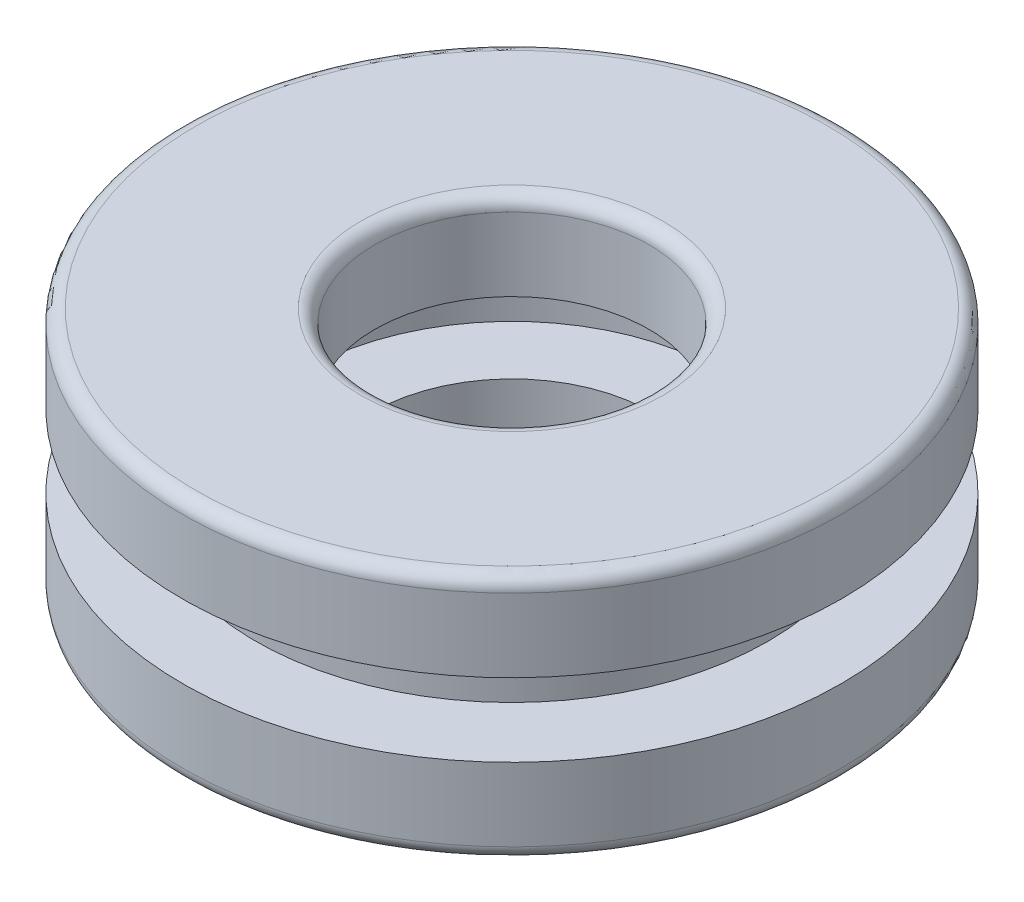
ISO-10303-21;
HEADER;
FILE_DESCRIPTION(('STEP AP214'),'2;1');
FILE_NAME('part.step','',(''),(''),'','','');
FILE_SCHEMA(('AUTOMOTIVE_DESIGN { 1 0 10303 214 1 1 1 1 }'));
ENDSEC;
DATA;
#1=APPLICATION_CONTEXT('core data for automotive mechanical design processes');
#2=APPLICATION_PROTOCOL_DEFINITION('international standard','automotive_design',2000,#1);
#3=PRODUCT_CONTEXT('',#1,'mechanical');
#4=PRODUCT('Part','Part','',(#3));
#5=PRODUCT_RELATED_PRODUCT_CATEGORY('part','',(#4));
#6=PRODUCT_DEFINITION_FORMATION('','',#4);
#7=PRODUCT_DEFINITION_CONTEXT('part definition',#1,'design');
#8=PRODUCT_DEFINITION('design','',#6,#7);
#9=PRODUCT_DEFINITION_SHAPE('','',#8);
#10=(LENGTH_UNIT() NAMED_UNIT(*) SI_UNIT(.MILLI.,.METRE.));
#11=(NAMED_UNIT(*) PLANE_ANGLE_UNIT() SI_UNIT($,.RADIAN.));
#12=(NAMED_UNIT(*) SI_UNIT($,.STERADIAN.) SOLID_ANGLE_UNIT());
#13=UNCERTAINTY_MEASURE_WITH_UNIT(LENGTH_MEASURE(1.E-05),#10,'distance_accuracy_value','');
#14=(GEOMETRIC_REPRESENTATION_CONTEXT(3) GLOBAL_UNCERTAINTY_ASSIGNED_CONTEXT((#13)) GLOBAL_UNIT_ASSIGNED_CONTEXT((#10,
#11,#12)) REPRESENTATION_CONTEXT('',''));
#15=CARTESIAN_POINT('',(0.,0.,0.));
#16=DIRECTION('',(0.,0.,1.));
#17=DIRECTION('',(1.,0.,0.));
#18=AXIS2_PLACEMENT_3D('',#15,#16,#17);
#19=CARTESIAN_POINT('',(3.49720252756924E-12,-1000.,-1.11022302462516E-13));
#20=DIRECTION('',(0.,-1.,0.));
#21=DIRECTION('',(1.,0.,0.));
#22=AXIS2_PLACEMENT_3D('',#19,#20,#21);
#23=CYLINDRICAL_SURFACE('',#22,5.10000000000001);
#24=CARTESIAN_POINT('',(-1.66533453693773E-13,0.499999999999945,0.));
#25=DIRECTION('',(0.,-1.,0.));
#26=DIRECTION('',(1.,0.,0.));
#27=AXIS2_PLACEMENT_3D('',#24,#25,#26);
#28=CIRCLE('',#27,5.1);
#29=CARTESIAN_POINT('',(5.09999999999984,0.499999999999963,0.));
#30=VERTEX_POINT('',#29);
#31=EDGE_CURVE('E10',#30,#30,#28,.T.);
#32=ORIENTED_EDGE('',*,*,#31,.T.);
#33=EDGE_LOOP('',(#32));
#34=FACE_BOUND('',#33,.T.);
#35=CARTESIAN_POINT('',(-1.66533453693773E-13,3.16666666666676,0.));
#36=DIRECTION('',(0.,-1.,0.));
#37=DIRECTION('',(1.,0.,0.));
#38=AXIS2_PLACEMENT_3D('',#35,#36,#37);
#39=CIRCLE('',#38,5.10000000000001);
#40=CARTESIAN_POINT('',(5.09999999999985,3.16666666666678,0.));
#41=VERTEX_POINT('',#40);
#42=EDGE_CURVE('E82',#41,#41,#39,.T.);
#43=ORIENTED_EDGE('',*,*,#42,.F.);
#44=EDGE_LOOP('',(#43));
#45=FACE_BOUND('',#44,.T.);
#46=ADVANCED_FACE('F30',(#34,#45),#23,.F.);
#47=CARTESIAN_POINT('',(-1.66533453693773E-13,0.5,0.));
#48=DIRECTION('',(0.,-1.,0.));
#49=DIRECTION('',(1.,0.,0.));
#50=AXIS2_PLACEMENT_3D('',#47,#48,#49);
#51=TOROIDAL_SURFACE('',#50,5.6,0.5);
#52=CARTESIAN_POINT('',(0.,0.,0.));
#53=DIRECTION('',(0.,-1.,0.));
#54=DIRECTION('',(1.,0.,0.));
#55=AXIS2_PLACEMENT_3D('',#52,#53,#54);
#56=CIRCLE('',#55,5.6);
#57=CARTESIAN_POINT('',(5.60000000000001,0.,0.));
#58=VERTEX_POINT('',#57);
#59=EDGE_CURVE('E36',#58,#58,#56,.T.);
#60=ORIENTED_EDGE('',*,*,#59,.T.);
#61=EDGE_LOOP('',(#60));
#62=FACE_BOUND('',#61,.T.);
#63=ORIENTED_EDGE('',*,*,#31,.F.);
#64=EDGE_LOOP('',(#63));
#65=FACE_BOUND('',#64,.T.);
#66=ADVANCED_FACE('F90',(#62,#65),#51,.T.);
#67=CARTESIAN_POINT('',(5.59999999999999,0.,1.11022302462516E-13));
#68=DIRECTION('',(0.,-1.,0.));
#69=DIRECTION('',(1.,0.,0.));
#70=AXIS2_PLACEMENT_3D('',#67,#68,#69);
#71=PLANE('',#70);
#72=CARTESIAN_POINT('',(0.,0.,0.));
#73=DIRECTION('',(0.,-1.,0.));
#74=DIRECTION('',(1.,0.,0.));
#75=AXIS2_PLACEMENT_3D('',#72,#73,#74);
#76=CIRCLE('',#75,11.5);
#77=CARTESIAN_POINT('',(11.5,0.,0.));
#78=VERTEX_POINT('',#77);
#79=EDGE_CURVE('E40',#78,#78,#76,.T.);
#80=ORIENTED_EDGE('',*,*,#79,.T.);
#81=EDGE_LOOP('',(#80));
#82=FACE_BOUND('',#81,.T.);
#83=ORIENTED_EDGE('',*,*,#59,.F.);
#84=EDGE_LOOP('',(#83));
#85=FACE_BOUND('',#84,.T.);
#86=ADVANCED_FACE('F94',(#82,#85),#71,.T.);
#87=CARTESIAN_POINT('',(-1.66533453693773E-13,0.5,0.));
#88=DIRECTION('',(0.,-1.,0.));
#89=DIRECTION('',(1.,0.,0.));
#90=AXIS2_PLACEMENT_3D('',#87,#88,#89);
#91=TOROIDAL_SURFACE('',#90,11.5,0.5);
#92=CARTESIAN_POINT('',(-1.66533453693773E-13,0.499999999999945,0.));
#93=DIRECTION('',(0.,-1.,0.));
#94=DIRECTION('',(1.,0.,0.));
#95=AXIS2_PLACEMENT_3D('',#92,#93,#94);
#96=CIRCLE('',#95,12.);
#97=CARTESIAN_POINT('',(11.9999999999998,0.499999999999987,0.));
#98=VERTEX_POINT('',#97);
#99=EDGE_CURVE('E44',#98,#98,#96,.T.);
#100=ORIENTED_EDGE('',*,*,#99,.T.);
#101=EDGE_LOOP('',(#100));
#102=FACE_BOUND('',#101,.T.);
#103=ORIENTED_EDGE('',*,*,#79,.F.);
#104=EDGE_LOOP('',(#103));
#105=FACE_BOUND('',#104,.T.);
#106=ADVANCED_FACE('F98',(#102,#105),#91,.T.);
#107=CARTESIAN_POINT('',(3.49720252756924E-12,-1000.,-1.11022302462516E-13));
#108=DIRECTION('',(0.,-1.,0.));
#109=DIRECTION('',(1.,0.,0.));
#110=AXIS2_PLACEMENT_3D('',#107,#108,#109);
#111=CYLINDRICAL_SURFACE('',#110,12.);
#112=CARTESIAN_POINT('',(-1.66533453693773E-13,3.16666666666676,0.));
#113=DIRECTION('',(0.,-1.,0.));
#114=DIRECTION('',(1.,0.,0.));
#115=AXIS2_PLACEMENT_3D('',#112,#113,#114);
#116=CIRCLE('',#115,12.);
#117=CARTESIAN_POINT('',(11.9999999999999,3.1666666666668,0.));
#118=VERTEX_POINT('',#117);
#119=EDGE_CURVE('E49',#118,#118,#116,.T.);
#120=ORIENTED_EDGE('',*,*,#119,.T.);
#121=EDGE_LOOP('',(#120));
#122=FACE_BOUND('',#121,.T.);
#123=ORIENTED_EDGE('',*,*,#99,.F.);
#124=EDGE_LOOP('',(#123));
#125=FACE_BOUND('',#124,.T.);
#126=ADVANCED_FACE('F105',(#122,#125),#111,.T.);
#127=CARTESIAN_POINT('',(9.33333333333336,3.16666666666666,0.));
#128=DIRECTION('',(0.,1.,0.));
#129=DIRECTION('',(-1.,0.,0.));
#130=AXIS2_PLACEMENT_3D('',#127,#128,#129);
#131=PLANE('',#130);
#132=CARTESIAN_POINT('',(-1.66533453693773E-13,3.16666666666676,0.));
#133=DIRECTION('',(0.,-1.,0.));
#134=DIRECTION('',(1.,0.,0.));
#135=AXIS2_PLACEMENT_3D('',#132,#133,#134);
#136=CIRCLE('',#135,9.33333333333336);
#137=CARTESIAN_POINT('',(9.3333333333332,3.16666666666679,0.));
#138=VERTEX_POINT('',#137);
#139=EDGE_CURVE('E52',#138,#138,#136,.T.);
#140=ORIENTED_EDGE('',*,*,#139,.T.);
#141=EDGE_LOOP('',(#140));
#142=FACE_BOUND('',#141,.T.);
#143=ORIENTED_EDGE('',*,*,#119,.F.);
#144=EDGE_LOOP('',(#143));
#145=FACE_BOUND('',#144,.T.);
#146=ADVANCED_FACE('F109',(#142,#145),#131,.T.);
#147=CARTESIAN_POINT('',(3.49720252756924E-12,-1000.,-1.11022302462516E-13));
#148=DIRECTION('',(0.,-1.,0.));
#149=DIRECTION('',(1.,0.,0.));
#150=AXIS2_PLACEMENT_3D('',#147,#148,#149);
#151=CYLINDRICAL_SURFACE('',#150,9.33333333333336);
#152=CARTESIAN_POINT('',(1.11022302462516E-13,5.83333333333336,0.));
#153=DIRECTION('',(0.,-1.,0.));
#154=DIRECTION('',(1.,0.,0.));
#155=AXIS2_PLACEMENT_3D('',#152,#153,#154);
#156=CIRCLE('',#155,9.33333333333337);
#157=CARTESIAN_POINT('',(9.33333333333348,5.83333333333339,0.));
#158=VERTEX_POINT('',#157);
#159=EDGE_CURVE('E55',#158,#158,#156,.T.);
#160=ORIENTED_EDGE('',*,*,#159,.T.);
#161=EDGE_LOOP('',(#160));
#162=FACE_BOUND('',#161,.T.);
#163=ORIENTED_EDGE('',*,*,#139,.F.);
#164=EDGE_LOOP('',(#163));
#165=FACE_BOUND('',#164,.T.);
#166=ADVANCED_FACE('F113',(#162,#165),#151,.T.);
#167=CARTESIAN_POINT('',(9.33333333333347,5.83333333333333,-1.66533453693773E-13));
#168=DIRECTION('',(0.,-1.,0.));
#169=DIRECTION('',(1.,0.,0.));
#170=AXIS2_PLACEMENT_3D('',#167,#168,#169);
#171=PLANE('',#170);
#172=CARTESIAN_POINT('',(1.11022302462516E-13,5.83333333333336,0.));
#173=DIRECTION('',(0.,-1.,0.));
#174=DIRECTION('',(1.,0.,0.));
#175=AXIS2_PLACEMENT_3D('',#172,#173,#174);
#176=CIRCLE('',#175,12.);
#177=CARTESIAN_POINT('',(12.0000000000002,5.8333333333334,0.));
#178=VERTEX_POINT('',#177);
#179=EDGE_CURVE('E58',#178,#178,#176,.T.);
#180=ORIENTED_EDGE('',*,*,#179,.T.);
#181=EDGE_LOOP('',(#180));
#182=FACE_BOUND('',#181,.T.);
#183=ORIENTED_EDGE('',*,*,#159,.F.);
#184=EDGE_LOOP('',(#183));
#185=FACE_BOUND('',#184,.T.);
#186=ADVANCED_FACE('F117',(#182,#185),#171,.T.);
#187=CARTESIAN_POINT('',(3.49720252756924E-12,-1000.,-1.11022302462516E-13));
#188=DIRECTION('',(0.,-1.,0.));
#189=DIRECTION('',(1.,0.,0.));
#190=AXIS2_PLACEMENT_3D('',#187,#188,#189);
#191=CYLINDRICAL_SURFACE('',#190,12.);
#192=CARTESIAN_POINT('',(-1.66533453693773E-13,8.49999999999995,0.));
#193=DIRECTION('',(0.,-1.,0.));
#194=DIRECTION('',(1.,0.,0.));
#195=AXIS2_PLACEMENT_3D('',#192,#193,#194);
#196=CIRCLE('',#195,12.);
#197=CARTESIAN_POINT('',(11.9999999999999,8.49999999999999,0.));
#198=VERTEX_POINT('',#197);
#199=EDGE_CURVE('E61',#198,#198,#196,.T.);
#200=ORIENTED_EDGE('',*,*,#199,.T.);
#201=EDGE_LOOP('',(#200));
#202=FACE_BOUND('',#201,.T.);
#203=ORIENTED_EDGE('',*,*,#179,.F.);
#204=EDGE_LOOP('',(#203));
#205=FACE_BOUND('',#204,.T.);
#206=ADVANCED_FACE('F121',(#202,#205),#191,.T.);
#207=CARTESIAN_POINT('',(-1.66533453693773E-13,8.5,0.));
#208=DIRECTION('',(0.,-1.,0.));
#209=DIRECTION('',(1.,0.,0.));
#210=AXIS2_PLACEMENT_3D('',#207,#208,#209);
#211=TOROIDAL_SURFACE('',#210,11.5,0.499999999999994);
#212=CARTESIAN_POINT('',(-1.66533453693773E-13,8.9999999999999,0.));
#213=DIRECTION('',(0.,-1.,0.));
#214=DIRECTION('',(1.,0.,0.));
#215=AXIS2_PLACEMENT_3D('',#212,#213,#214);
#216=CIRCLE('',#215,11.5);
#217=CARTESIAN_POINT('',(11.4999999999999,8.99999999999994,0.));
#218=VERTEX_POINT('',#217);
#219=EDGE_CURVE('E64',#218,#218,#216,.T.);
#220=ORIENTED_EDGE('',*,*,#219,.T.);
#221=EDGE_LOOP('',(#220));
#222=FACE_BOUND('',#221,.T.);
#223=ORIENTED_EDGE('',*,*,#199,.F.);
#224=EDGE_LOOP('',(#223));
#225=FACE_BOUND('',#224,.T.);
#226=ADVANCED_FACE('F125',(#222,#225),#211,.T.);
#227=CARTESIAN_POINT('',(5.49999999999984,8.99999999999999,1.11022302462516E-13));
#228=DIRECTION('',(0.,1.,0.));
#229=DIRECTION('',(-1.,0.,0.));
#230=AXIS2_PLACEMENT_3D('',#227,#228,#229);
#231=PLANE('',#230);
#232=CARTESIAN_POINT('',(-1.66533453693773E-13,8.9999999999999,0.));
#233=DIRECTION('',(0.,-1.,0.));
#234=DIRECTION('',(1.,0.,0.));
#235=AXIS2_PLACEMENT_3D('',#232,#233,#234);
#236=CIRCLE('',#235,5.50000000000004);
#237=CARTESIAN_POINT('',(5.49999999999988,8.99999999999992,0.));
#238=VERTEX_POINT('',#237);
#239=EDGE_CURVE('E67',#238,#238,#236,.T.);
#240=ORIENTED_EDGE('',*,*,#239,.T.);
#241=EDGE_LOOP('',(#240));
#242=FACE_BOUND('',#241,.T.);
#243=ORIENTED_EDGE('',*,*,#219,.F.);
#244=EDGE_LOOP('',(#243));
#245=FACE_BOUND('',#244,.T.);
#246=ADVANCED_FACE('F129',(#242,#245),#231,.T.);
#247=CARTESIAN_POINT('',(-1.66533453693773E-13,8.5,0.));
#248=DIRECTION('',(0.,-1.,0.));
#249=DIRECTION('',(1.,0.,0.));
#250=AXIS2_PLACEMENT_3D('',#247,#248,#249);
#251=TOROIDAL_SURFACE('',#250,5.50000000000004,0.5);
#252=CARTESIAN_POINT('',(-1.66533453693773E-13,8.49999999999995,0.));
#253=DIRECTION('',(0.,-1.,0.));
#254=DIRECTION('',(1.,0.,0.));
#255=AXIS2_PLACEMENT_3D('',#252,#253,#254);
#256=CIRCLE('',#255,5.00000000000003);
#257=CARTESIAN_POINT('',(4.99999999999987,8.49999999999997,0.));
#258=VERTEX_POINT('',#257);
#259=EDGE_CURVE('E70',#258,#258,#256,.T.);
#260=ORIENTED_EDGE('',*,*,#259,.T.);
#261=EDGE_LOOP('',(#260));
#262=FACE_BOUND('',#261,.T.);
#263=ORIENTED_EDGE('',*,*,#239,.F.);
#264=EDGE_LOOP('',(#263));
#265=FACE_BOUND('',#264,.T.);
#266=ADVANCED_FACE('F133',(#262,#265),#251,.T.);
#267=CARTESIAN_POINT('',(3.49720252756924E-12,-1000.,-1.11022302462516E-13));
#268=DIRECTION('',(0.,-1.,0.));
#269=DIRECTION('',(1.,0.,0.));
#270=AXIS2_PLACEMENT_3D('',#267,#268,#269);
#271=CYLINDRICAL_SURFACE('',#270,5.00000000000003);
#272=CARTESIAN_POINT('',(1.11022302462516E-13,5.83333333333336,0.));
#273=DIRECTION('',(0.,-1.,0.));
#274=DIRECTION('',(1.,0.,0.));
#275=AXIS2_PLACEMENT_3D('',#272,#273,#274);
#276=CIRCLE('',#275,5.00000000000002);
#277=CARTESIAN_POINT('',(5.00000000000014,5.83333333333337,0.));
#278=VERTEX_POINT('',#277);
#279=EDGE_CURVE('E73',#278,#278,#276,.T.);
#280=ORIENTED_EDGE('',*,*,#279,.T.);
#281=EDGE_LOOP('',(#280));
#282=FACE_BOUND('',#281,.T.);
#283=ORIENTED_EDGE('',*,*,#259,.F.);
#284=EDGE_LOOP('',(#283));
#285=FACE_BOUND('',#284,.T.);
#286=ADVANCED_FACE('F137',(#282,#285),#271,.F.);
#287=CARTESIAN_POINT('',(5.00000000000012,5.83333333333334,0.));
#288=DIRECTION('',(0.,-1.,0.));
#289=DIRECTION('',(1.,0.,0.));
#290=AXIS2_PLACEMENT_3D('',#287,#288,#289);
#291=PLANE('',#290);
#292=CARTESIAN_POINT('',(1.11022302462516E-13,5.83333333333336,0.));
#293=DIRECTION('',(0.,-1.,0.));
#294=DIRECTION('',(1.,0.,0.));
#295=AXIS2_PLACEMENT_3D('',#292,#293,#294);
#296=CIRCLE('',#295,7.66666666666669);
#297=CARTESIAN_POINT('',(7.66666666666681,5.83333333333338,0.));
#298=VERTEX_POINT('',#297);
#299=EDGE_CURVE('E76',#298,#298,#296,.T.);
#300=ORIENTED_EDGE('',*,*,#299,.T.);
#301=EDGE_LOOP('',(#300));
#302=FACE_BOUND('',#301,.T.);
#303=ORIENTED_EDGE('',*,*,#279,.F.);
#304=EDGE_LOOP('',(#303));
#305=FACE_BOUND('',#304,.T.);
#306=ADVANCED_FACE('F141',(#302,#305),#291,.T.);
#307=CARTESIAN_POINT('',(3.49720252756924E-12,-1000.,-1.11022302462516E-13));
#308=DIRECTION('',(0.,-1.,0.));
#309=DIRECTION('',(1.,0.,0.));
#310=AXIS2_PLACEMENT_3D('',#307,#308,#309);
#311=CYLINDRICAL_SURFACE('',#310,7.66666666666668);
#312=CARTESIAN_POINT('',(-1.66533453693773E-13,3.16666666666676,0.));
#313=DIRECTION('',(0.,-1.,0.));
#314=DIRECTION('',(1.,0.,0.));
#315=AXIS2_PLACEMENT_3D('',#312,#313,#314);
#316=CIRCLE('',#315,7.66666666666668);
#317=CARTESIAN_POINT('',(7.66666666666652,3.16666666666679,0.));
#318=VERTEX_POINT('',#317);
#319=EDGE_CURVE('E79',#318,#318,#316,.T.);
#320=ORIENTED_EDGE('',*,*,#319,.T.);
#321=EDGE_LOOP('',(#320));
#322=FACE_BOUND('',#321,.T.);
#323=ORIENTED_EDGE('',*,*,#299,.F.);
#324=EDGE_LOOP('',(#323));
#325=FACE_BOUND('',#324,.T.);
#326=ADVANCED_FACE('F145',(#322,#325),#311,.F.);
#327=CARTESIAN_POINT('',(5.09999999999994,3.16666666666669,0.));
#328=DIRECTION('',(0.,1.,0.));
#329=DIRECTION('',(-1.,0.,0.));
#330=AXIS2_PLACEMENT_3D('',#327,#328,#329);
#331=PLANE('',#330);
#332=ORIENTED_EDGE('',*,*,#42,.T.);
#333=EDGE_LOOP('',(#332));
#334=FACE_BOUND('',#333,.T.);
#335=ORIENTED_EDGE('',*,*,#319,.F.);
#336=EDGE_LOOP('',(#335));
#337=FACE_BOUND('',#336,.T.);
#338=ADVANCED_FACE('F86',(#334,#337),#331,.T.);
#339=CLOSED_SHELL('',(#46,#66,#86,#106,#126,#146,#166,#186,#206,#226,#246,#266,#286,#306,#326,#338));
#340=MANIFOLD_SOLID_BREP('B2',#339);
#341=ADVANCED_BREP_SHAPE_REPRESENTATION('',(#18,#340),#14);
#342=SHAPE_DEFINITION_REPRESENTATION(#9,#341);
ENDSEC;
END-ISO-10303-21;
